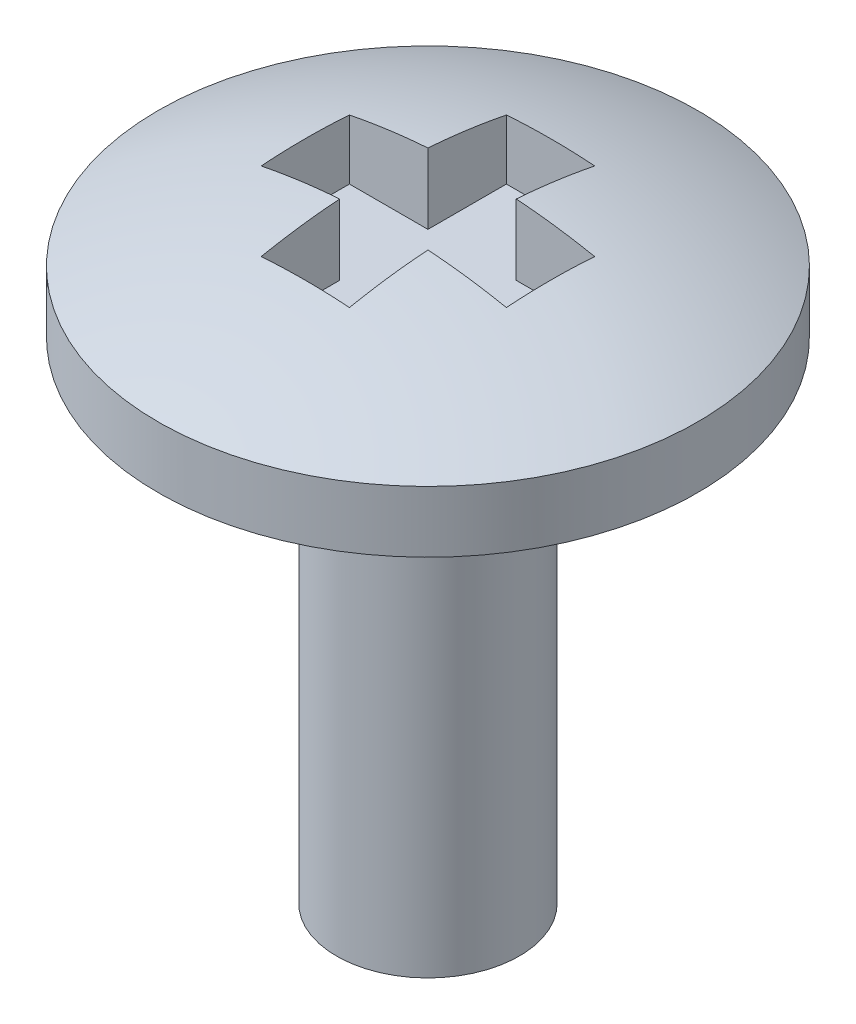
ISO-10303-21;
HEADER;
FILE_DESCRIPTION(('STEP AP214'),'2;1');
FILE_NAME('part.step','',(''),(''),'','','');
FILE_SCHEMA(('AUTOMOTIVE_DESIGN { 1 0 10303 214 1 1 1 1 }'));
ENDSEC;
DATA;
#1=APPLICATION_CONTEXT('core data for automotive mechanical design processes');
#2=APPLICATION_PROTOCOL_DEFINITION('international standard','automotive_design',2000,#1);
#3=PRODUCT_CONTEXT('',#1,'mechanical');
#4=PRODUCT('Part','Part','',(#3));
#5=PRODUCT_RELATED_PRODUCT_CATEGORY('part','',(#4));
#6=PRODUCT_DEFINITION_FORMATION('','',#4);
#7=PRODUCT_DEFINITION_CONTEXT('part definition',#1,'design');
#8=PRODUCT_DEFINITION('design','',#6,#7);
#9=PRODUCT_DEFINITION_SHAPE('','',#8);
#10=(LENGTH_UNIT() NAMED_UNIT(*) SI_UNIT(.MILLI.,.METRE.));
#11=(NAMED_UNIT(*) PLANE_ANGLE_UNIT() SI_UNIT($,.RADIAN.));
#12=(NAMED_UNIT(*) SI_UNIT($,.STERADIAN.) SOLID_ANGLE_UNIT());
#13=UNCERTAINTY_MEASURE_WITH_UNIT(LENGTH_MEASURE(1.E-05),#10,'distance_accuracy_value','');
#14=(GEOMETRIC_REPRESENTATION_CONTEXT(3) GLOBAL_UNCERTAINTY_ASSIGNED_CONTEXT((#13)) GLOBAL_UNIT_ASSIGNED_CONTEXT((#10,
#11,#12)) REPRESENTATION_CONTEXT('',''));
#15=CARTESIAN_POINT('',(0.,0.,0.));
#16=DIRECTION('',(0.,0.,1.));
#17=DIRECTION('',(1.,0.,0.));
#18=AXIS2_PLACEMENT_3D('',#15,#16,#17);
#19=CARTESIAN_POINT('',(0.,-6.4643,0.));
#20=DIRECTION('',(0.,1.,0.));
#21=DIRECTION('',(1.,0.,0.));
#22=AXIS2_PLACEMENT_3D('',#19,#20,#21);
#23=SPHERICAL_SURFACE('',#22,6.4643);
#24=CARTESIAN_POINT('',(0.,-6.4643,-1.27));
#25=DIRECTION('',(0.,0.,-1.));
#26=DIRECTION('',(-1.,0.,0.));
#27=AXIS2_PLACEMENT_3D('',#24,#25,#26);
#28=CIRCLE('',#27,6.33831795431564);
#29=CARTESIAN_POINT('',(-0.4572,-0.142493086624679,-1.27));
#30=VERTEX_POINT('',#29);
#31=CARTESIAN_POINT('',(0.4572,-0.142493086624679,-1.27));
#32=VERTEX_POINT('',#31);
#33=EDGE_CURVE('E48',#30,#32,#28,.T.);
#34=ORIENTED_EDGE('',*,*,#33,.T.);
#35=CARTESIAN_POINT('',(0.457200000000001,-6.4643,0.));
#36=DIRECTION('',(1.,0.,0.));
#37=DIRECTION('',(0.,0.,-1.));
#38=AXIS2_PLACEMENT_3D('',#35,#36,#37);
#39=CIRCLE('',#38,6.44811155688237);
#40=CARTESIAN_POINT('',(0.4572,-0.0324176308952916,-0.4572));
#41=VERTEX_POINT('',#40);
#42=EDGE_CURVE('E11',#32,#41,#39,.T.);
#43=ORIENTED_EDGE('',*,*,#42,.T.);
#44=CARTESIAN_POINT('',(0.,-6.4643,-0.4572));
#45=DIRECTION('',(0.,0.,-1.));
#46=DIRECTION('',(-1.,0.,0.));
#47=AXIS2_PLACEMENT_3D('',#44,#45,#46);
#48=CIRCLE('',#47,6.44811155688237);
#49=CARTESIAN_POINT('',(1.27,-0.142493086624679,-0.4572));
#50=VERTEX_POINT('',#49);
#51=EDGE_CURVE('E130',#41,#50,#48,.T.);
#52=ORIENTED_EDGE('',*,*,#51,.T.);
#53=CARTESIAN_POINT('',(1.27,-6.4643,0.));
#54=DIRECTION('',(1.,0.,0.));
#55=DIRECTION('',(0.,1.,0.));
#56=AXIS2_PLACEMENT_3D('',#53,#54,#55);
#57=CIRCLE('',#56,6.33831795431564);
#58=CARTESIAN_POINT('',(1.27,-0.142493086624679,0.4572));
#59=VERTEX_POINT('',#58);
#60=EDGE_CURVE('E237',#50,#59,#57,.T.);
#61=ORIENTED_EDGE('',*,*,#60,.T.);
#62=CARTESIAN_POINT('',(0.,-6.4643,0.4572));
#63=DIRECTION('',(0.,0.,1.));
#64=DIRECTION('',(1.,0.,0.));
#65=AXIS2_PLACEMENT_3D('',#62,#63,#64);
#66=CIRCLE('',#65,6.44811155688237);
#67=CARTESIAN_POINT('',(0.4572,-0.0324176308952916,0.4572));
#68=VERTEX_POINT('',#67);
#69=EDGE_CURVE('E241',#59,#68,#66,.T.);
#70=ORIENTED_EDGE('',*,*,#69,.T.);
#71=CARTESIAN_POINT('',(0.457200000000001,-6.4643,0.));
#72=DIRECTION('',(1.,0.,0.));
#73=DIRECTION('',(0.,1.,0.));
#74=AXIS2_PLACEMENT_3D('',#71,#72,#73);
#75=CIRCLE('',#74,6.44811155688237);
#76=CARTESIAN_POINT('',(0.4572,-0.142493086624679,1.27));
#77=VERTEX_POINT('',#76);
#78=EDGE_CURVE('E245',#68,#77,#75,.T.);
#79=ORIENTED_EDGE('',*,*,#78,.T.);
#80=CARTESIAN_POINT('',(0.,-6.4643,1.27));
#81=DIRECTION('',(0.,0.,1.));
#82=DIRECTION('',(1.,0.,0.));
#83=AXIS2_PLACEMENT_3D('',#80,#81,#82);
#84=CIRCLE('',#83,6.33831795431564);
#85=CARTESIAN_POINT('',(-0.4572,-0.142493086624679,1.27));
#86=VERTEX_POINT('',#85);
#87=EDGE_CURVE('E249',#77,#86,#84,.T.);
#88=ORIENTED_EDGE('',*,*,#87,.T.);
#89=CARTESIAN_POINT('',(-0.457199999999999,-6.4643,0.));
#90=DIRECTION('',(-1.,0.,0.));
#91=DIRECTION('',(0.,0.,1.));
#92=AXIS2_PLACEMENT_3D('',#89,#90,#91);
#93=CIRCLE('',#92,6.44811155688237);
#94=CARTESIAN_POINT('',(-0.4572,-0.0324176308952916,0.4572));
#95=VERTEX_POINT('',#94);
#96=EDGE_CURVE('E253',#86,#95,#93,.T.);
#97=ORIENTED_EDGE('',*,*,#96,.T.);
#98=CARTESIAN_POINT('',(0.,-6.4643,0.4572));
#99=DIRECTION('',(0.,0.,1.));
#100=DIRECTION('',(1.,0.,0.));
#101=AXIS2_PLACEMENT_3D('',#98,#99,#100);
#102=CIRCLE('',#101,6.44811155688237);
#103=CARTESIAN_POINT('',(-1.27,-0.142493086624679,0.4572));
#104=VERTEX_POINT('',#103);
#105=EDGE_CURVE('E257',#95,#104,#102,.T.);
#106=ORIENTED_EDGE('',*,*,#105,.T.);
#107=CARTESIAN_POINT('',(-1.27,-6.4643,0.));
#108=DIRECTION('',(-1.,0.,0.));
#109=DIRECTION('',(0.,-1.,0.));
#110=AXIS2_PLACEMENT_3D('',#107,#108,#109);
#111=CIRCLE('',#110,6.33831795431564);
#112=CARTESIAN_POINT('',(-1.27,-0.142493086624679,-0.4572));
#113=VERTEX_POINT('',#112);
#114=EDGE_CURVE('E261',#104,#113,#111,.T.);
#115=ORIENTED_EDGE('',*,*,#114,.T.);
#116=CARTESIAN_POINT('',(0.,-6.4643,-0.4572));
#117=DIRECTION('',(0.,0.,-1.));
#118=DIRECTION('',(-1.,0.,0.));
#119=AXIS2_PLACEMENT_3D('',#116,#117,#118);
#120=CIRCLE('',#119,6.44811155688237);
#121=CARTESIAN_POINT('',(-0.4572,-0.0324176308952916,-0.4572));
#122=VERTEX_POINT('',#121);
#123=EDGE_CURVE('E265',#113,#122,#120,.T.);
#124=ORIENTED_EDGE('',*,*,#123,.T.);
#125=CARTESIAN_POINT('',(-0.457199999999999,-6.4643,0.));
#126=DIRECTION('',(-1.,0.,0.));
#127=DIRECTION('',(0.,0.,1.));
#128=AXIS2_PLACEMENT_3D('',#125,#126,#127);
#129=CIRCLE('',#128,6.44811155688237);
#130=EDGE_CURVE('E269',#122,#30,#129,.T.);
#131=ORIENTED_EDGE('',*,*,#130,.T.);
#132=EDGE_LOOP('',(#34,#43,#52,#61,#70,#79,#88,#97,#106,#115,#124,#131));
#133=FACE_BOUND('',#132,.T.);
#134=CARTESIAN_POINT('',(0.,-0.635,0.));
#135=DIRECTION('',(0.,1.,0.));
#136=DIRECTION('',(-1.,0.,0.));
#137=AXIS2_PLACEMENT_3D('',#134,#135,#136);
#138=CIRCLE('',#137,2.794);
#139=CARTESIAN_POINT('',(-2.794,-0.635000000000001,0.));
#140=VERTEX_POINT('',#139);
#141=EDGE_CURVE('E231',#140,#140,#138,.T.);
#142=ORIENTED_EDGE('',*,*,#141,.T.);
#143=EDGE_LOOP('',(#142));
#144=FACE_BOUND('',#143,.T.);
#145=ADVANCED_FACE('F40',(#133,#144),#23,.T.);
#146=CARTESIAN_POINT('',(0.,0.,0.));
#147=DIRECTION('',(0.,1.,0.));
#148=DIRECTION('',(-1.,0.,0.));
#149=AXIS2_PLACEMENT_3D('',#146,#147,#148);
#150=CYLINDRICAL_SURFACE('',#149,2.794);
#151=ORIENTED_EDGE('',*,*,#141,.F.);
#152=EDGE_LOOP('',(#151));
#153=FACE_BOUND('',#152,.T.);
#154=CARTESIAN_POINT('',(0.,-1.27,0.));
#155=DIRECTION('',(0.,1.,0.));
#156=DIRECTION('',(-1.,0.,0.));
#157=AXIS2_PLACEMENT_3D('',#154,#155,#156);
#158=CIRCLE('',#157,2.794);
#159=CARTESIAN_POINT('',(-2.794,-1.27,0.));
#160=VERTEX_POINT('',#159);
#161=EDGE_CURVE('E227',#160,#160,#158,.T.);
#162=ORIENTED_EDGE('',*,*,#161,.T.);
#163=EDGE_LOOP('',(#162));
#164=FACE_BOUND('',#163,.T.);
#165=ADVANCED_FACE('F321',(#153,#164),#150,.T.);
#166=CARTESIAN_POINT('',(0.946564988005572,-1.27,0.));
#167=DIRECTION('',(0.,1.,0.));
#168=DIRECTION('',(-1.,0.,0.));
#169=AXIS2_PLACEMENT_3D('',#166,#167,#168);
#170=PLANE('',#169);
#171=ORIENTED_EDGE('',*,*,#161,.F.);
#172=EDGE_LOOP('',(#171));
#173=FACE_BOUND('',#172,.T.);
#174=CARTESIAN_POINT('',(0.,-1.27,0.));
#175=DIRECTION('',(0.,1.,0.));
#176=DIRECTION('',(-1.,0.,0.));
#177=AXIS2_PLACEMENT_3D('',#174,#175,#176);
#178=CIRCLE('',#177,0.946564988005572);
#179=CARTESIAN_POINT('',(-0.946564988005572,-1.27,0.));
#180=VERTEX_POINT('',#179);
#181=EDGE_CURVE('E223',#180,#180,#178,.T.);
#182=ORIENTED_EDGE('',*,*,#181,.T.);
#183=EDGE_LOOP('',(#182));
#184=FACE_BOUND('',#183,.T.);
#185=ADVANCED_FACE('F325',(#173,#184),#170,.F.);
#186=CARTESIAN_POINT('',(0.,0.,0.));
#187=DIRECTION('',(0.,1.,0.));
#188=DIRECTION('',(-1.,0.,0.));
#189=AXIS2_PLACEMENT_3D('',#186,#187,#188);
#190=CYLINDRICAL_SURFACE('',#189,0.946564988005571);
#191=ORIENTED_EDGE('',*,*,#181,.F.);
#192=EDGE_LOOP('',(#191));
#193=FACE_BOUND('',#192,.T.);
#194=CARTESIAN_POINT('',(0.,-6.35,0.));
#195=DIRECTION('',(0.,1.,0.));
#196=DIRECTION('',(-1.,0.,0.));
#197=AXIS2_PLACEMENT_3D('',#194,#195,#196);
#198=CIRCLE('',#197,0.946564988005571);
#199=CARTESIAN_POINT('',(-0.94656498800557,-6.35,0.));
#200=VERTEX_POINT('',#199);
#201=EDGE_CURVE('E190',#200,#200,#198,.T.);
#202=ORIENTED_EDGE('',*,*,#201,.T.);
#203=EDGE_LOOP('',(#202));
#204=FACE_BOUND('',#203,.T.);
#205=ADVANCED_FACE('F330',(#193,#204),#190,.T.);
#206=CARTESIAN_POINT('',(0.,-6.35,0.));
#207=DIRECTION('',(0.,1.,0.));
#208=DIRECTION('',(-1.,0.,0.));
#209=AXIS2_PLACEMENT_3D('',#206,#207,#208);
#210=PLANE('',#209);
#211=ORIENTED_EDGE('',*,*,#201,.F.);
#212=EDGE_LOOP('',(#211));
#213=FACE_BOUND('',#212,.T.);
#214=ADVANCED_FACE('F338',(#213),#210,.F.);
#215=CARTESIAN_POINT('',(0.4572,1.778,-1.27));
#216=DIRECTION('',(1.,0.,0.));
#217=DIRECTION('',(0.,0.,-1.));
#218=AXIS2_PLACEMENT_3D('',#215,#216,#217);
#219=PLANE('',#218);
#220=DIRECTION('',(0.,-1.,0.));
#221=VECTOR('',#220,1.);
#222=CARTESIAN_POINT('',(0.4572,1.778,-1.27));
#223=LINE('',#222,#221);
#224=CARTESIAN_POINT('',(0.4572,-0.762,-1.27));
#225=VERTEX_POINT('',#224);
#226=EDGE_CURVE('E148',#32,#225,#223,.T.);
#227=ORIENTED_EDGE('',*,*,#226,.T.);
#228=DIRECTION('',(0.,0.,1.));
#229=VECTOR('',#228,1.);
#230=CARTESIAN_POINT('',(0.4572,-0.762,-1.27));
#231=LINE('',#230,#229);
#232=CARTESIAN_POINT('',(0.4572,-0.762,-0.4572));
#233=VERTEX_POINT('',#232);
#234=EDGE_CURVE('E140',#225,#233,#231,.T.);
#235=ORIENTED_EDGE('',*,*,#234,.T.);
#236=DIRECTION('',(0.,-1.,0.));
#237=VECTOR('',#236,1.);
#238=CARTESIAN_POINT('',(0.4572,1.778,-0.4572));
#239=LINE('',#238,#237);
#240=EDGE_CURVE('E125',#41,#233,#239,.T.);
#241=ORIENTED_EDGE('',*,*,#240,.F.);
#242=ORIENTED_EDGE('',*,*,#42,.F.);
#243=EDGE_LOOP('',(#227,#235,#241,#242));
#244=FACE_BOUND('',#243,.T.);
#245=ADVANCED_FACE('F147',(#244),#219,.F.);
#246=CARTESIAN_POINT('',(0.4572,1.778,-1.27));
#247=DIRECTION('',(0.,0.,-1.));
#248=DIRECTION('',(-1.,0.,0.));
#249=AXIS2_PLACEMENT_3D('',#246,#247,#248);
#250=PLANE('',#249);
#251=DIRECTION('',(0.,-1.,0.));
#252=VECTOR('',#251,1.);
#253=CARTESIAN_POINT('',(-0.4572,1.778,-1.27));
#254=LINE('',#253,#252);
#255=CARTESIAN_POINT('',(-0.4572,-0.762000000000001,-1.27));
#256=VERTEX_POINT('',#255);
#257=EDGE_CURVE('E191',#30,#256,#254,.T.);
#258=ORIENTED_EDGE('',*,*,#257,.T.);
#259=DIRECTION('',(1.,0.,0.));
#260=VECTOR('',#259,1.);
#261=CARTESIAN_POINT('',(0.4572,-0.762,-1.27));
#262=LINE('',#261,#260);
#263=EDGE_CURVE('E133',#256,#225,#262,.T.);
#264=ORIENTED_EDGE('',*,*,#263,.T.);
#265=ORIENTED_EDGE('',*,*,#226,.F.);
#266=ORIENTED_EDGE('',*,*,#33,.F.);
#267=EDGE_LOOP('',(#258,#264,#265,#266));
#268=FACE_BOUND('',#267,.T.);
#269=ADVANCED_FACE('F278',(#268),#250,.F.);
#270=CARTESIAN_POINT('',(-0.4572,1.778,-1.27));
#271=DIRECTION('',(-1.,0.,0.));
#272=DIRECTION('',(0.,0.,1.));
#273=AXIS2_PLACEMENT_3D('',#270,#271,#272);
#274=PLANE('',#273);
#275=DIRECTION('',(0.,-1.,0.));
#276=VECTOR('',#275,1.);
#277=CARTESIAN_POINT('',(-0.4572,1.778,-0.4572));
#278=LINE('',#277,#276);
#279=CARTESIAN_POINT('',(-0.4572,-0.762000000000001,-0.4572));
#280=VERTEX_POINT('',#279);
#281=EDGE_CURVE('E194',#122,#280,#278,.T.);
#282=ORIENTED_EDGE('',*,*,#281,.T.);
#283=DIRECTION('',(0.,0.,-1.));
#284=VECTOR('',#283,1.);
#285=CARTESIAN_POINT('',(-0.4572,-0.762000000000001,-1.27));
#286=LINE('',#285,#284);
#287=EDGE_CURVE('E182',#280,#256,#286,.T.);
#288=ORIENTED_EDGE('',*,*,#287,.T.);
#289=ORIENTED_EDGE('',*,*,#257,.F.);
#290=ORIENTED_EDGE('',*,*,#130,.F.);
#291=EDGE_LOOP('',(#282,#288,#289,#290));
#292=FACE_BOUND('',#291,.T.);
#293=ADVANCED_FACE('F280',(#292),#274,.F.);
#294=CARTESIAN_POINT('',(-1.27,1.778,-0.4572));
#295=DIRECTION('',(0.,0.,-1.));
#296=DIRECTION('',(-1.,0.,0.));
#297=AXIS2_PLACEMENT_3D('',#294,#295,#296);
#298=PLANE('',#297);
#299=DIRECTION('',(0.,-1.,0.));
#300=VECTOR('',#299,1.);
#301=CARTESIAN_POINT('',(-1.27,1.778,-0.4572));
#302=LINE('',#301,#300);
#303=CARTESIAN_POINT('',(-1.27,-0.762000000000001,-0.4572));
#304=VERTEX_POINT('',#303);
#305=EDGE_CURVE('E197',#113,#304,#302,.T.);
#306=ORIENTED_EDGE('',*,*,#305,.T.);
#307=DIRECTION('',(1.,0.,0.));
#308=VECTOR('',#307,1.);
#309=CARTESIAN_POINT('',(-1.27,-0.762000000000001,-0.4572));
#310=LINE('',#309,#308);
#311=EDGE_CURVE('E178',#304,#280,#310,.T.);
#312=ORIENTED_EDGE('',*,*,#311,.T.);
#313=ORIENTED_EDGE('',*,*,#281,.F.);
#314=ORIENTED_EDGE('',*,*,#123,.F.);
#315=EDGE_LOOP('',(#306,#312,#313,#314));
#316=FACE_BOUND('',#315,.T.);
#317=ADVANCED_FACE('F286',(#316),#298,.F.);
#318=CARTESIAN_POINT('',(-1.27,1.778,-0.4572));
#319=DIRECTION('',(-1.,0.,0.));
#320=DIRECTION('',(0.,-1.,0.));
#321=AXIS2_PLACEMENT_3D('',#318,#319,#320);
#322=PLANE('',#321);
#323=DIRECTION('',(0.,-1.,0.));
#324=VECTOR('',#323,1.);
#325=CARTESIAN_POINT('',(-1.27,1.778,0.4572));
#326=LINE('',#325,#324);
#327=CARTESIAN_POINT('',(-1.27,-0.762000000000001,0.4572));
#328=VERTEX_POINT('',#327);
#329=EDGE_CURVE('E200',#104,#328,#326,.T.);
#330=ORIENTED_EDGE('',*,*,#329,.T.);
#331=DIRECTION('',(0.,0.,-1.));
#332=VECTOR('',#331,1.);
#333=CARTESIAN_POINT('',(-1.27,-0.762000000000001,-0.4572));
#334=LINE('',#333,#332);
#335=EDGE_CURVE('E174',#328,#304,#334,.T.);
#336=ORIENTED_EDGE('',*,*,#335,.T.);
#337=ORIENTED_EDGE('',*,*,#305,.F.);
#338=ORIENTED_EDGE('',*,*,#114,.F.);
#339=EDGE_LOOP('',(#330,#336,#337,#338));
#340=FACE_BOUND('',#339,.T.);
#341=ADVANCED_FACE('F289',(#340),#322,.F.);
#342=CARTESIAN_POINT('',(-1.27,1.778,0.4572));
#343=DIRECTION('',(0.,0.,1.));
#344=DIRECTION('',(1.,0.,0.));
#345=AXIS2_PLACEMENT_3D('',#342,#343,#344);
#346=PLANE('',#345);
#347=DIRECTION('',(0.,-1.,0.));
#348=VECTOR('',#347,1.);
#349=CARTESIAN_POINT('',(-0.4572,1.778,0.4572));
#350=LINE('',#349,#348);
#351=CARTESIAN_POINT('',(-0.4572,-0.762000000000001,0.4572));
#352=VERTEX_POINT('',#351);
#353=EDGE_CURVE('E203',#95,#352,#350,.T.);
#354=ORIENTED_EDGE('',*,*,#353,.T.);
#355=DIRECTION('',(-1.,0.,0.));
#356=VECTOR('',#355,1.);
#357=CARTESIAN_POINT('',(-1.27,-0.762000000000001,0.4572));
#358=LINE('',#357,#356);
#359=EDGE_CURVE('E170',#352,#328,#358,.T.);
#360=ORIENTED_EDGE('',*,*,#359,.T.);
#361=ORIENTED_EDGE('',*,*,#329,.F.);
#362=ORIENTED_EDGE('',*,*,#105,.F.);
#363=EDGE_LOOP('',(#354,#360,#361,#362));
#364=FACE_BOUND('',#363,.T.);
#365=ADVANCED_FACE('F293',(#364),#346,.F.);
#366=CARTESIAN_POINT('',(-0.4572,1.778,0.4572));
#367=DIRECTION('',(-1.,0.,0.));
#368=DIRECTION('',(0.,0.,1.));
#369=AXIS2_PLACEMENT_3D('',#366,#367,#368);
#370=PLANE('',#369);
#371=DIRECTION('',(0.,-1.,0.));
#372=VECTOR('',#371,1.);
#373=CARTESIAN_POINT('',(-0.4572,1.778,1.27));
#374=LINE('',#373,#372);
#375=CARTESIAN_POINT('',(-0.457199999999999,-0.762000000000001,1.27));
#376=VERTEX_POINT('',#375);
#377=EDGE_CURVE('E206',#86,#376,#374,.T.);
#378=ORIENTED_EDGE('',*,*,#377,.T.);
#379=DIRECTION('',(0.,0.,-1.));
#380=VECTOR('',#379,1.);
#381=CARTESIAN_POINT('',(-0.4572,-0.762000000000001,0.4572));
#382=LINE('',#381,#380);
#383=EDGE_CURVE('E166',#376,#352,#382,.T.);
#384=ORIENTED_EDGE('',*,*,#383,.T.);
#385=ORIENTED_EDGE('',*,*,#353,.F.);
#386=ORIENTED_EDGE('',*,*,#96,.F.);
#387=EDGE_LOOP('',(#378,#384,#385,#386));
#388=FACE_BOUND('',#387,.T.);
#389=ADVANCED_FACE('F296',(#388),#370,.F.);
#390=CARTESIAN_POINT('',(-0.4572,1.778,1.27));
#391=DIRECTION('',(0.,0.,1.));
#392=DIRECTION('',(1.,0.,0.));
#393=AXIS2_PLACEMENT_3D('',#390,#391,#392);
#394=PLANE('',#393);
#395=DIRECTION('',(0.,-1.,0.));
#396=VECTOR('',#395,1.);
#397=CARTESIAN_POINT('',(0.457199999999999,1.778,1.27));
#398=LINE('',#397,#396);
#399=CARTESIAN_POINT('',(0.4572,-0.762,1.27));
#400=VERTEX_POINT('',#399);
#401=EDGE_CURVE('E209',#77,#400,#398,.T.);
#402=ORIENTED_EDGE('',*,*,#401,.T.);
#403=DIRECTION('',(-1.,0.,0.));
#404=VECTOR('',#403,1.);
#405=CARTESIAN_POINT('',(-0.457199999999999,-0.762000000000001,1.27));
#406=LINE('',#405,#404);
#407=EDGE_CURVE('E162',#400,#376,#406,.T.);
#408=ORIENTED_EDGE('',*,*,#407,.T.);
#409=ORIENTED_EDGE('',*,*,#377,.F.);
#410=ORIENTED_EDGE('',*,*,#87,.F.);
#411=EDGE_LOOP('',(#402,#408,#409,#410));
#412=FACE_BOUND('',#411,.T.);
#413=ADVANCED_FACE('F302',(#412),#394,.F.);
#414=CARTESIAN_POINT('',(0.457199999999999,1.778,0.4572));
#415=DIRECTION('',(1.,0.,0.));
#416=DIRECTION('',(0.,1.,0.));
#417=AXIS2_PLACEMENT_3D('',#414,#415,#416);
#418=PLANE('',#417);
#419=DIRECTION('',(0.,-1.,0.));
#420=VECTOR('',#419,1.);
#421=CARTESIAN_POINT('',(0.457199999999999,1.778,0.4572));
#422=LINE('',#421,#420);
#423=CARTESIAN_POINT('',(0.4572,-0.762,0.4572));
#424=VERTEX_POINT('',#423);
#425=EDGE_CURVE('E212',#68,#424,#422,.T.);
#426=ORIENTED_EDGE('',*,*,#425,.T.);
#427=DIRECTION('',(0.,0.,1.));
#428=VECTOR('',#427,1.);
#429=CARTESIAN_POINT('',(0.4572,-0.762,0.4572));
#430=LINE('',#429,#428);
#431=EDGE_CURVE('E158',#424,#400,#430,.T.);
#432=ORIENTED_EDGE('',*,*,#431,.T.);
#433=ORIENTED_EDGE('',*,*,#401,.F.);
#434=ORIENTED_EDGE('',*,*,#78,.F.);
#435=EDGE_LOOP('',(#426,#432,#433,#434));
#436=FACE_BOUND('',#435,.T.);
#437=ADVANCED_FACE('F305',(#436),#418,.F.);
#438=CARTESIAN_POINT('',(0.457199999999999,1.778,0.4572));
#439=DIRECTION('',(0.,0.,1.));
#440=DIRECTION('',(1.,0.,0.));
#441=AXIS2_PLACEMENT_3D('',#438,#439,#440);
#442=PLANE('',#441);
#443=DIRECTION('',(0.,-1.,0.));
#444=VECTOR('',#443,1.);
#445=CARTESIAN_POINT('',(1.27,1.778,0.4572));
#446=LINE('',#445,#444);
#447=CARTESIAN_POINT('',(1.27,-0.762,0.4572));
#448=VERTEX_POINT('',#447);
#449=EDGE_CURVE('E215',#59,#448,#446,.T.);
#450=ORIENTED_EDGE('',*,*,#449,.T.);
#451=DIRECTION('',(-1.,0.,0.));
#452=VECTOR('',#451,1.);
#453=CARTESIAN_POINT('',(0.4572,-0.762,0.4572));
#454=LINE('',#453,#452);
#455=EDGE_CURVE('E154',#448,#424,#454,.T.);
#456=ORIENTED_EDGE('',*,*,#455,.T.);
#457=ORIENTED_EDGE('',*,*,#425,.F.);
#458=ORIENTED_EDGE('',*,*,#69,.F.);
#459=EDGE_LOOP('',(#450,#456,#457,#458));
#460=FACE_BOUND('',#459,.T.);
#461=ADVANCED_FACE('F309',(#460),#442,.F.);
#462=CARTESIAN_POINT('',(1.27,1.778,-0.4572));
#463=DIRECTION('',(1.,0.,0.));
#464=DIRECTION('',(0.,1.,0.));
#465=AXIS2_PLACEMENT_3D('',#462,#463,#464);
#466=PLANE('',#465);
#467=DIRECTION('',(0.,-1.,0.));
#468=VECTOR('',#467,1.);
#469=CARTESIAN_POINT('',(1.27,1.778,-0.4572));
#470=LINE('',#469,#468);
#471=CARTESIAN_POINT('',(1.27,-0.762,-0.4572));
#472=VERTEX_POINT('',#471);
#473=EDGE_CURVE('E55',#50,#472,#470,.T.);
#474=ORIENTED_EDGE('',*,*,#473,.T.);
#475=DIRECTION('',(0.,0.,1.));
#476=VECTOR('',#475,1.);
#477=CARTESIAN_POINT('',(1.27,-0.762,-0.4572));
#478=LINE('',#477,#476);
#479=EDGE_CURVE('E144',#472,#448,#478,.T.);
#480=ORIENTED_EDGE('',*,*,#479,.T.);
#481=ORIENTED_EDGE('',*,*,#449,.F.);
#482=ORIENTED_EDGE('',*,*,#60,.F.);
#483=EDGE_LOOP('',(#474,#480,#481,#482));
#484=FACE_BOUND('',#483,.T.);
#485=ADVANCED_FACE('F311',(#484),#466,.F.);
#486=CARTESIAN_POINT('',(0.4572,1.778,-0.4572));
#487=DIRECTION('',(0.,0.,-1.));
#488=DIRECTION('',(-1.,0.,0.));
#489=AXIS2_PLACEMENT_3D('',#486,#487,#488);
#490=PLANE('',#489);
#491=ORIENTED_EDGE('',*,*,#240,.T.);
#492=DIRECTION('',(1.,0.,0.));
#493=VECTOR('',#492,1.);
#494=CARTESIAN_POINT('',(0.4572,-0.762,-0.4572));
#495=LINE('',#494,#493);
#496=EDGE_CURVE('E128',#233,#472,#495,.T.);
#497=ORIENTED_EDGE('',*,*,#496,.T.);
#498=ORIENTED_EDGE('',*,*,#473,.F.);
#499=ORIENTED_EDGE('',*,*,#51,.F.);
#500=EDGE_LOOP('',(#491,#497,#498,#499));
#501=FACE_BOUND('',#500,.T.);
#502=ADVANCED_FACE('F127',(#501),#490,.F.);
#503=CARTESIAN_POINT('',(0.4572,-0.762,-0.4572));
#504=DIRECTION('',(0.,1.,0.));
#505=DIRECTION('',(0.,0.,1.));
#506=AXIS2_PLACEMENT_3D('',#503,#504,#505);
#507=PLANE('',#506);
#508=ORIENTED_EDGE('',*,*,#234,.F.);
#509=ORIENTED_EDGE('',*,*,#263,.F.);
#510=ORIENTED_EDGE('',*,*,#287,.F.);
#511=ORIENTED_EDGE('',*,*,#311,.F.);
#512=ORIENTED_EDGE('',*,*,#335,.F.);
#513=ORIENTED_EDGE('',*,*,#359,.F.);
#514=ORIENTED_EDGE('',*,*,#383,.F.);
#515=ORIENTED_EDGE('',*,*,#407,.F.);
#516=ORIENTED_EDGE('',*,*,#431,.F.);
#517=ORIENTED_EDGE('',*,*,#455,.F.);
#518=ORIENTED_EDGE('',*,*,#479,.F.);
#519=ORIENTED_EDGE('',*,*,#496,.F.);
#520=EDGE_LOOP('',(#508,#509,#510,#511,#512,#513,#514,#515,#516,#517,#518,#519));
#521=FACE_BOUND('',#520,.T.);
#522=ADVANCED_FACE('F138',(#521),#507,.T.);
#523=CLOSED_SHELL('',(#145,#165,#185,#205,#214,#245,#269,#293,#317,#341,#365,#389,#413,#437,
#461,#485,#502,#522));
#524=MANIFOLD_SOLID_BREP('B2',#523);
#525=ADVANCED_BREP_SHAPE_REPRESENTATION('',(#18,#524),#14);
#526=SHAPE_DEFINITION_REPRESENTATION(#9,#525);
ENDSEC;
END-ISO-10303-21;
